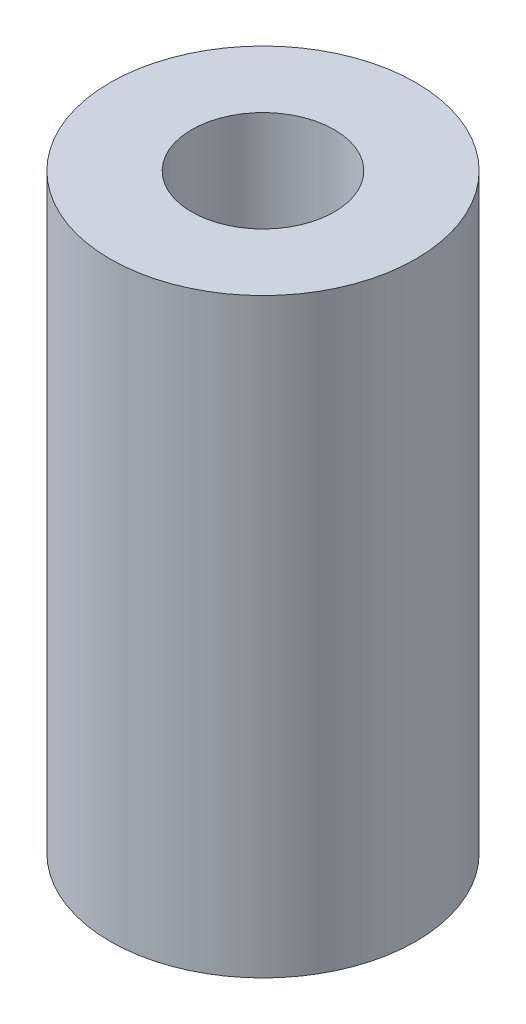
ISO-10303-21;
HEADER;
FILE_DESCRIPTION(('STEP AP214'),'2;1');
FILE_NAME('part.step','',(''),(''),'','','');
FILE_SCHEMA(('AUTOMOTIVE_DESIGN { 1 0 10303 214 1 1 1 1 }'));
ENDSEC;
DATA;
#1=APPLICATION_CONTEXT('core data for automotive mechanical design processes');
#2=APPLICATION_PROTOCOL_DEFINITION('international standard','automotive_design',2000,#1);
#3=PRODUCT_CONTEXT('',#1,'mechanical');
#4=PRODUCT('Part','Part','',(#3));
#5=PRODUCT_RELATED_PRODUCT_CATEGORY('part','',(#4));
#6=PRODUCT_DEFINITION_FORMATION('','',#4);
#7=PRODUCT_DEFINITION_CONTEXT('part definition',#1,'design');
#8=PRODUCT_DEFINITION('design','',#6,#7);
#9=PRODUCT_DEFINITION_SHAPE('','',#8);
#10=(LENGTH_UNIT() NAMED_UNIT(*) SI_UNIT(.MILLI.,.METRE.));
#11=(NAMED_UNIT(*) PLANE_ANGLE_UNIT() SI_UNIT($,.RADIAN.));
#12=(NAMED_UNIT(*) SI_UNIT($,.STERADIAN.) SOLID_ANGLE_UNIT());
#13=UNCERTAINTY_MEASURE_WITH_UNIT(LENGTH_MEASURE(1.E-05),#10,'distance_accuracy_value','');
#14=(GEOMETRIC_REPRESENTATION_CONTEXT(3) GLOBAL_UNCERTAINTY_ASSIGNED_CONTEXT((#13)) GLOBAL_UNIT_ASSIGNED_CONTEXT((#10,
#11,#12)) REPRESENTATION_CONTEXT('',''));
#15=CARTESIAN_POINT('',(0.,0.,0.));
#16=DIRECTION('',(0.,0.,1.));
#17=DIRECTION('',(1.,0.,0.));
#18=AXIS2_PLACEMENT_3D('',#15,#16,#17);
#19=CARTESIAN_POINT('',(0.,29.,0.));
#20=DIRECTION('',(0.,1.,0.));
#21=DIRECTION('',(0.,0.,1.));
#22=AXIS2_PLACEMENT_3D('',#19,#20,#21);
#23=PLANE('',#22);
#24=CARTESIAN_POINT('',(0.,29.,0.));
#25=DIRECTION('',(0.,1.,0.));
#26=DIRECTION('',(0.,0.,1.));
#27=AXIS2_PLACEMENT_3D('',#24,#25,#26);
#28=CIRCLE('',#27,15.);
#29=CARTESIAN_POINT('',(0.,29.,-15.));
#30=VERTEX_POINT('',#29);
#31=EDGE_CURVE('E10',#30,#30,#28,.T.);
#32=ORIENTED_EDGE('',*,*,#31,.T.);
#33=EDGE_LOOP('',(#32));
#34=FACE_BOUND('',#33,.T.);
#35=CARTESIAN_POINT('',(0.,29.,0.));
#36=DIRECTION('',(0.,1.,0.));
#37=DIRECTION('',(0.,0.,1.));
#38=AXIS2_PLACEMENT_3D('',#35,#36,#37);
#39=CIRCLE('',#38,7.);
#40=CARTESIAN_POINT('',(0.,29.,-7.));
#41=VERTEX_POINT('',#40);
#42=EDGE_CURVE('E43',#41,#41,#39,.T.);
#43=ORIENTED_EDGE('',*,*,#42,.F.);
#44=EDGE_LOOP('',(#43));
#45=FACE_BOUND('',#44,.T.);
#46=ADVANCED_FACE('F32',(#34,#45),#23,.T.);
#47=CARTESIAN_POINT('',(0.,-29.,0.));
#48=DIRECTION('',(0.,1.,0.));
#49=DIRECTION('',(0.,0.,1.));
#50=AXIS2_PLACEMENT_3D('',#47,#48,#49);
#51=PLANE('',#50);
#52=CARTESIAN_POINT('',(0.,-29.,0.));
#53=DIRECTION('',(0.,1.,0.));
#54=DIRECTION('',(0.,0.,1.));
#55=AXIS2_PLACEMENT_3D('',#52,#53,#54);
#56=CIRCLE('',#55,15.);
#57=CARTESIAN_POINT('',(0.,-29.,-15.));
#58=VERTEX_POINT('',#57);
#59=EDGE_CURVE('E36',#58,#58,#56,.T.);
#60=ORIENTED_EDGE('',*,*,#59,.F.);
#61=EDGE_LOOP('',(#60));
#62=FACE_BOUND('',#61,.T.);
#63=CARTESIAN_POINT('',(0.,-29.,0.));
#64=DIRECTION('',(0.,1.,0.));
#65=DIRECTION('',(0.,0.,1.));
#66=AXIS2_PLACEMENT_3D('',#63,#64,#65);
#67=CIRCLE('',#66,7.);
#68=CARTESIAN_POINT('',(0.,-29.,-7.));
#69=VERTEX_POINT('',#68);
#70=EDGE_CURVE('E45',#69,#69,#67,.T.);
#71=ORIENTED_EDGE('',*,*,#70,.T.);
#72=EDGE_LOOP('',(#71));
#73=FACE_BOUND('',#72,.T.);
#74=ADVANCED_FACE('F55',(#62,#73),#51,.F.);
#75=CARTESIAN_POINT('',(0.,29.,0.));
#76=DIRECTION('',(0.,-1.,0.));
#77=DIRECTION('',(0.,0.,-1.));
#78=AXIS2_PLACEMENT_3D('',#75,#76,#77);
#79=CYLINDRICAL_SURFACE('',#78,15.);
#80=CARTESIAN_POINT('',(0.,29.,-15.));
#81=CARTESIAN_POINT('',(0.,28.3958333333333,-15.));
#82=CARTESIAN_POINT('',(0.,27.7916666666667,-15.));
#83=CARTESIAN_POINT('',(0.,26.5833333333333,-15.));
#84=CARTESIAN_POINT('',(0.,25.9791666666667,-15.));
#85=CARTESIAN_POINT('',(0.,24.7708333333333,-15.));
#86=CARTESIAN_POINT('',(0.,24.1666666666667,-15.));
#87=CARTESIAN_POINT('',(0.,22.9583333333333,-15.));
#88=CARTESIAN_POINT('',(0.,22.3541666666667,-15.));
#89=CARTESIAN_POINT('',(0.,21.1458333333333,-15.));
#90=CARTESIAN_POINT('',(0.,20.5416666666667,-15.));
#91=CARTESIAN_POINT('',(0.,19.3333333333333,-15.));
#92=CARTESIAN_POINT('',(0.,18.7291666666667,-15.));
#93=CARTESIAN_POINT('',(0.,17.5208333333333,-15.));
#94=CARTESIAN_POINT('',(0.,16.9166666666667,-15.));
#95=CARTESIAN_POINT('',(0.,15.7083333333333,-15.));
#96=CARTESIAN_POINT('',(0.,15.1041666666667,-15.));
#97=CARTESIAN_POINT('',(0.,13.8958333333333,-15.));
#98=CARTESIAN_POINT('',(0.,13.2916666666667,-15.));
#99=CARTESIAN_POINT('',(0.,12.0833333333333,-15.));
#100=CARTESIAN_POINT('',(0.,11.4791666666667,-15.));
#101=CARTESIAN_POINT('',(0.,10.2708333333333,-15.));
#102=CARTESIAN_POINT('',(0.,9.66666666666667,-15.));
#103=CARTESIAN_POINT('',(0.,8.45833333333333,-15.));
#104=CARTESIAN_POINT('',(0.,7.85416666666666,-15.));
#105=CARTESIAN_POINT('',(0.,6.64583333333333,-15.));
#106=CARTESIAN_POINT('',(0.,6.04166666666666,-15.));
#107=CARTESIAN_POINT('',(0.,4.83333333333333,-15.));
#108=CARTESIAN_POINT('',(0.,4.22916666666666,-15.));
#109=CARTESIAN_POINT('',(0.,3.02083333333333,-15.));
#110=CARTESIAN_POINT('',(0.,2.41666666666666,-15.));
#111=CARTESIAN_POINT('',(0.,1.20833333333333,-15.));
#112=CARTESIAN_POINT('',(0.,0.604166666666664,-15.));
#113=CARTESIAN_POINT('',(0.,-0.604166666666671,-15.));
#114=CARTESIAN_POINT('',(0.,-1.20833333333334,-15.));
#115=CARTESIAN_POINT('',(0.,-2.41666666666667,-15.));
#116=CARTESIAN_POINT('',(0.,-3.02083333333333,-15.));
#117=CARTESIAN_POINT('',(0.,-4.22916666666667,-15.));
#118=CARTESIAN_POINT('',(0.,-4.83333333333333,-15.));
#119=CARTESIAN_POINT('',(0.,-6.04166666666666,-15.));
#120=CARTESIAN_POINT('',(0.,-6.64583333333333,-15.));
#121=CARTESIAN_POINT('',(0.,-7.85416666666666,-15.));
#122=CARTESIAN_POINT('',(0.,-8.45833333333333,-15.));
#123=CARTESIAN_POINT('',(0.,-9.66666666666667,-15.));
#124=CARTESIAN_POINT('',(0.,-10.2708333333333,-15.));
#125=CARTESIAN_POINT('',(0.,-11.4791666666667,-15.));
#126=CARTESIAN_POINT('',(0.,-12.0833333333333,-15.));
#127=CARTESIAN_POINT('',(0.,-13.2916666666667,-15.));
#128=CARTESIAN_POINT('',(0.,-13.8958333333333,-15.));
#129=CARTESIAN_POINT('',(0.,-15.1041666666667,-15.));
#130=CARTESIAN_POINT('',(0.,-15.7083333333333,-15.));
#131=CARTESIAN_POINT('',(0.,-16.9166666666667,-15.));
#132=CARTESIAN_POINT('',(0.,-17.5208333333333,-15.));
#133=CARTESIAN_POINT('',(0.,-18.7291666666667,-15.));
#134=CARTESIAN_POINT('',(0.,-19.3333333333333,-15.));
#135=CARTESIAN_POINT('',(0.,-20.5416666666667,-15.));
#136=CARTESIAN_POINT('',(0.,-21.1458333333333,-15.));
#137=CARTESIAN_POINT('',(0.,-22.3541666666667,-15.));
#138=CARTESIAN_POINT('',(0.,-22.9583333333333,-15.));
#139=CARTESIAN_POINT('',(0.,-24.1666666666667,-15.));
#140=CARTESIAN_POINT('',(0.,-24.7708333333333,-15.));
#141=CARTESIAN_POINT('',(0.,-25.9791666666667,-15.));
#142=CARTESIAN_POINT('',(0.,-26.5833333333333,-15.));
#143=CARTESIAN_POINT('',(0.,-27.7916666666667,-15.));
#144=CARTESIAN_POINT('',(0.,-28.3958333333333,-15.));
#145=CARTESIAN_POINT('',(0.,-29.,-15.));
#146=B_SPLINE_CURVE_WITH_KNOTS('',3,(#80,#81,#82,#83,#84,#85,#86,#87,#88,#89,#90,#91,#92,#93,
#94,#95,#96,#97,#98,#99,#100,#101,#102,#103,#104,#105,#106,#107,#108,#109,#110,#111,#112,#113,
#114,#115,#116,#117,#118,#119,#120,#121,#122,#123,#124,#125,#126,#127,#128,#129,#130,#131,#132,
#133,#134,#135,#136,#137,#138,#139,#140,#141,#142,#143,#144,#145),.UNSPECIFIED.,.F.,.F.,(4,2,2,
2,2,2,2,2,2,2,2,2,2,2,2,2,2,2,2,2,2,2,2,2,2,2,2,2,2,2,2,2,4),(0.,1.8125,3.625,5.4375,7.25,
9.0625,10.875,12.6875,14.5,16.3125,18.125,19.9375,21.75,23.5625,25.375,27.1875,29.,30.8125,
32.625,34.4375,36.25,38.0625,39.875,41.6875,43.5,45.3125,47.125,48.9375,50.75,52.5625,54.375,
56.1875,58.),.UNSPECIFIED.);
#147=EDGE_CURVE('BSEAM34',#30,#58,#146,.T.);
#148=ORIENTED_EDGE('',*,*,#31,.F.);
#149=ORIENTED_EDGE('',*,*,#59,.T.);
#150=ORIENTED_EDGE('',*,*,#147,.T.);
#151=ORIENTED_EDGE('',*,*,#147,.F.);
#152=EDGE_LOOP('',(#148,#150,#149,#151));
#153=FACE_BOUND('',#152,.T.);
#154=ADVANCED_FACE('F34',(#153),#79,.T.);
#155=CARTESIAN_POINT('',(0.,29.,0.));
#156=DIRECTION('',(0.,-1.,0.));
#157=DIRECTION('',(0.,0.,-1.));
#158=AXIS2_PLACEMENT_3D('',#155,#156,#157);
#159=CYLINDRICAL_SURFACE('',#158,7.);
#160=CARTESIAN_POINT('',(0.,29.,-7.));
#161=CARTESIAN_POINT('',(0.,28.3958333333333,-7.));
#162=CARTESIAN_POINT('',(0.,27.7916666666667,-7.));
#163=CARTESIAN_POINT('',(0.,26.5833333333333,-7.));
#164=CARTESIAN_POINT('',(0.,25.9791666666667,-7.));
#165=CARTESIAN_POINT('',(0.,24.7708333333333,-7.));
#166=CARTESIAN_POINT('',(0.,24.1666666666667,-7.));
#167=CARTESIAN_POINT('',(0.,22.9583333333333,-7.));
#168=CARTESIAN_POINT('',(0.,22.3541666666667,-7.));
#169=CARTESIAN_POINT('',(0.,21.1458333333333,-7.));
#170=CARTESIAN_POINT('',(0.,20.5416666666667,-7.));
#171=CARTESIAN_POINT('',(0.,19.3333333333333,-7.));
#172=CARTESIAN_POINT('',(0.,18.7291666666667,-7.));
#173=CARTESIAN_POINT('',(0.,17.5208333333333,-7.));
#174=CARTESIAN_POINT('',(0.,16.9166666666667,-7.));
#175=CARTESIAN_POINT('',(0.,15.7083333333333,-7.));
#176=CARTESIAN_POINT('',(0.,15.1041666666667,-7.));
#177=CARTESIAN_POINT('',(0.,13.8958333333333,-7.));
#178=CARTESIAN_POINT('',(0.,13.2916666666667,-7.));
#179=CARTESIAN_POINT('',(0.,12.0833333333333,-7.));
#180=CARTESIAN_POINT('',(0.,11.4791666666667,-7.));
#181=CARTESIAN_POINT('',(0.,10.2708333333333,-7.));
#182=CARTESIAN_POINT('',(0.,9.66666666666667,-7.));
#183=CARTESIAN_POINT('',(0.,8.45833333333333,-7.));
#184=CARTESIAN_POINT('',(0.,7.85416666666667,-7.));
#185=CARTESIAN_POINT('',(0.,6.64583333333333,-7.));
#186=CARTESIAN_POINT('',(0.,6.04166666666667,-7.));
#187=CARTESIAN_POINT('',(0.,4.83333333333333,-7.));
#188=CARTESIAN_POINT('',(0.,4.22916666666667,-7.));
#189=CARTESIAN_POINT('',(0.,3.02083333333333,-7.));
#190=CARTESIAN_POINT('',(0.,2.41666666666667,-7.));
#191=CARTESIAN_POINT('',(0.,1.20833333333333,-7.));
#192=CARTESIAN_POINT('',(0.,0.604166666666667,-7.));
#193=CARTESIAN_POINT('',(0.,-0.604166666666667,-7.));
#194=CARTESIAN_POINT('',(0.,-1.20833333333333,-7.));
#195=CARTESIAN_POINT('',(0.,-2.41666666666667,-7.));
#196=CARTESIAN_POINT('',(0.,-3.02083333333333,-7.));
#197=CARTESIAN_POINT('',(0.,-4.22916666666667,-7.));
#198=CARTESIAN_POINT('',(0.,-4.83333333333333,-7.));
#199=CARTESIAN_POINT('',(0.,-6.04166666666666,-7.));
#200=CARTESIAN_POINT('',(0.,-6.64583333333333,-7.));
#201=CARTESIAN_POINT('',(0.,-7.85416666666666,-7.));
#202=CARTESIAN_POINT('',(0.,-8.45833333333333,-7.));
#203=CARTESIAN_POINT('',(0.,-9.66666666666667,-7.));
#204=CARTESIAN_POINT('',(0.,-10.2708333333333,-7.));
#205=CARTESIAN_POINT('',(0.,-11.4791666666667,-7.));
#206=CARTESIAN_POINT('',(0.,-12.0833333333333,-7.));
#207=CARTESIAN_POINT('',(0.,-13.2916666666667,-7.));
#208=CARTESIAN_POINT('',(0.,-13.8958333333333,-7.));
#209=CARTESIAN_POINT('',(0.,-15.1041666666667,-7.));
#210=CARTESIAN_POINT('',(0.,-15.7083333333333,-7.));
#211=CARTESIAN_POINT('',(0.,-16.9166666666667,-7.));
#212=CARTESIAN_POINT('',(0.,-17.5208333333333,-7.));
#213=CARTESIAN_POINT('',(0.,-18.7291666666667,-7.));
#214=CARTESIAN_POINT('',(0.,-19.3333333333333,-7.));
#215=CARTESIAN_POINT('',(0.,-20.5416666666667,-7.));
#216=CARTESIAN_POINT('',(0.,-21.1458333333333,-7.));
#217=CARTESIAN_POINT('',(0.,-22.3541666666667,-7.));
#218=CARTESIAN_POINT('',(0.,-22.9583333333333,-7.));
#219=CARTESIAN_POINT('',(0.,-24.1666666666667,-7.));
#220=CARTESIAN_POINT('',(0.,-24.7708333333333,-7.));
#221=CARTESIAN_POINT('',(0.,-25.9791666666667,-7.));
#222=CARTESIAN_POINT('',(0.,-26.5833333333333,-7.));
#223=CARTESIAN_POINT('',(0.,-27.7916666666667,-7.));
#224=CARTESIAN_POINT('',(0.,-28.3958333333333,-7.));
#225=CARTESIAN_POINT('',(0.,-29.,-7.));
#226=B_SPLINE_CURVE_WITH_KNOTS('',3,(#160,#161,#162,#163,#164,#165,#166,#167,#168,#169,#170,
#171,#172,#173,#174,#175,#176,#177,#178,#179,#180,#181,#182,#183,#184,#185,#186,#187,#188,#189,
#190,#191,#192,#193,#194,#195,#196,#197,#198,#199,#200,#201,#202,#203,#204,#205,#206,#207,#208,
#209,#210,#211,#212,#213,#214,#215,#216,#217,#218,#219,#220,#221,#222,#223,#224,#225),
.UNSPECIFIED.,.F.,.F.,(4,2,2,2,2,2,2,2,2,2,2,2,2,2,2,2,2,2,2,2,2,2,2,2,2,2,2,2,2,2,2,2,4),(0.,
1.8125,3.625,5.4375,7.25,9.0625,10.875,12.6875,14.5,16.3125,18.125,19.9375,21.75,23.5625,25.375,
27.1875,29.,30.8125,32.625,34.4375,36.25,38.0625,39.875,41.6875,43.5,45.3125,47.125,48.9375,
50.75,52.5625,54.375,56.1875,58.),.UNSPECIFIED.);
#227=EDGE_CURVE('BSEAM51',#41,#69,#226,.T.);
#228=ORIENTED_EDGE('',*,*,#42,.T.);
#229=ORIENTED_EDGE('',*,*,#70,.F.);
#230=ORIENTED_EDGE('',*,*,#227,.T.);
#231=ORIENTED_EDGE('',*,*,#227,.F.);
#232=EDGE_LOOP('',(#228,#230,#229,#231));
#233=FACE_BOUND('',#232,.T.);
#234=ADVANCED_FACE('F51',(#233),#159,.F.);
#235=CLOSED_SHELL('',(#46,#74,#154,#234));
#236=MANIFOLD_SOLID_BREP('B2',#235);
#237=ADVANCED_BREP_SHAPE_REPRESENTATION('',(#18,#236),#14);
#238=SHAPE_DEFINITION_REPRESENTATION(#9,#237);
ENDSEC;
END-ISO-10303-21;
